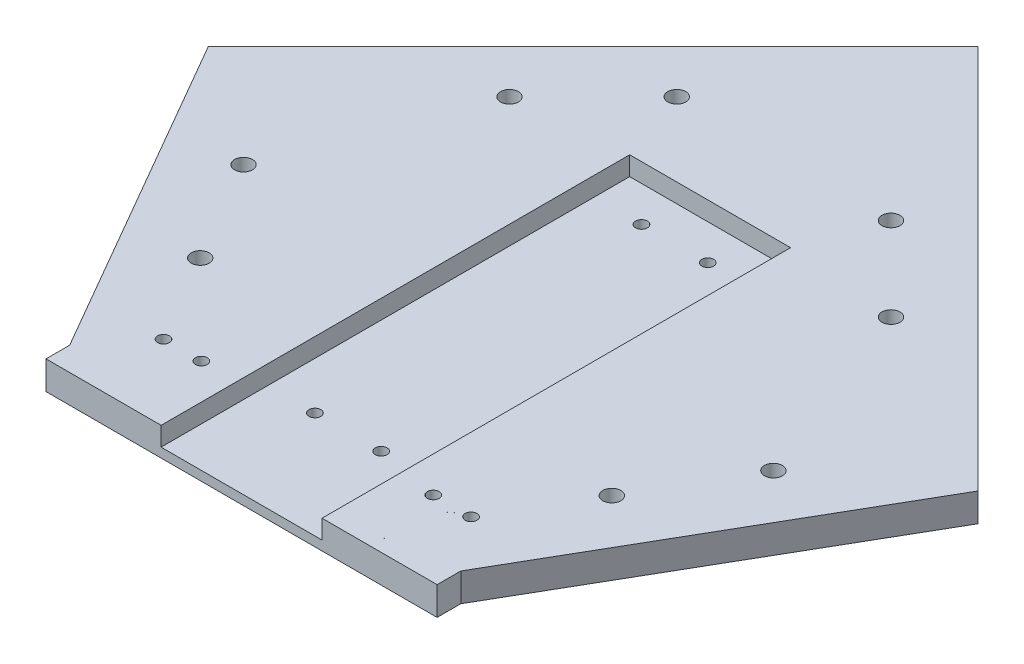
ISO-10303-21;
HEADER;
FILE_DESCRIPTION(('STEP AP214'),'2;1');
FILE_NAME('part.step','',(''),(''),'','','');
FILE_SCHEMA(('AUTOMOTIVE_DESIGN { 1 0 10303 214 1 1 1 1 }'));
ENDSEC;
DATA;
#1=APPLICATION_CONTEXT('core data for automotive mechanical design processes');
#2=APPLICATION_PROTOCOL_DEFINITION('international standard','automotive_design',2000,#1);
#3=PRODUCT_CONTEXT('',#1,'mechanical');
#4=PRODUCT('Part','Part','',(#3));
#5=PRODUCT_RELATED_PRODUCT_CATEGORY('part','',(#4));
#6=PRODUCT_DEFINITION_FORMATION('','',#4);
#7=PRODUCT_DEFINITION_CONTEXT('part definition',#1,'design');
#8=PRODUCT_DEFINITION('design','',#6,#7);
#9=PRODUCT_DEFINITION_SHAPE('','',#8);
#10=(LENGTH_UNIT() NAMED_UNIT(*) SI_UNIT(.MILLI.,.METRE.));
#11=(NAMED_UNIT(*) PLANE_ANGLE_UNIT() SI_UNIT($,.RADIAN.));
#12=(NAMED_UNIT(*) SI_UNIT($,.STERADIAN.) SOLID_ANGLE_UNIT());
#13=UNCERTAINTY_MEASURE_WITH_UNIT(LENGTH_MEASURE(1.E-05),#10,'distance_accuracy_value','');
#14=(GEOMETRIC_REPRESENTATION_CONTEXT(3) GLOBAL_UNCERTAINTY_ASSIGNED_CONTEXT((#13)) GLOBAL_UNIT_ASSIGNED_CONTEXT((#10,
#11,#12)) REPRESENTATION_CONTEXT('',''));
#15=CARTESIAN_POINT('',(0.,0.,0.));
#16=DIRECTION('',(0.,0.,1.));
#17=DIRECTION('',(1.,0.,0.));
#18=AXIS2_PLACEMENT_3D('',#15,#16,#17);
#19=CARTESIAN_POINT('',(0.,6.,0.));
#20=DIRECTION('',(0.,1.,0.));
#21=DIRECTION('',(0.,0.,1.));
#22=AXIS2_PLACEMENT_3D('',#19,#20,#21);
#23=PLANE('',#22);
#24=CARTESIAN_POINT('',(28.5022798364536,6.,73.3791697838743));
#25=DIRECTION('',(0.,1.,0.));
#26=DIRECTION('',(0.,0.,1.));
#27=AXIS2_PLACEMENT_3D('',#24,#25,#26);
#28=CIRCLE('',#27,1.8);
#29=CARTESIAN_POINT('',(28.4999999999973,6.,75.1791683400809));
#30=VERTEX_POINT('',#29);
#31=CARTESIAN_POINT('',(28.4999999999973,6.,71.5791712276678));
#32=VERTEX_POINT('',#31);
#33=EDGE_CURVE('E179',#30,#32,#28,.T.);
#34=ORIENTED_EDGE('',*,*,#33,.F.);
#35=CARTESIAN_POINT('',(28.4977201635464,6.,73.3791697838743));
#36=DIRECTION('',(0.,-1.,0.));
#37=DIRECTION('',(0.,0.,1.));
#38=AXIS2_PLACEMENT_3D('',#35,#36,#37);
#39=CIRCLE('',#38,1.79999999999999);
#40=EDGE_CURVE('E156',#32,#30,#39,.T.);
#41=ORIENTED_EDGE('',*,*,#40,.F.);
#42=EDGE_LOOP('',(#34,#41));
#43=FACE_BOUND('',#42,.T.);
#44=CARTESIAN_POINT('',(32.4977201635464,6.,73.3791697838743));
#45=DIRECTION('',(0.,-1.,0.));
#46=DIRECTION('',(0.,0.,1.));
#47=AXIS2_PLACEMENT_3D('',#44,#45,#46);
#48=CIRCLE('',#47,1.25);
#49=CARTESIAN_POINT('',(32.4977201635464,6.,74.6291697838743));
#50=VERTEX_POINT('',#49);
#51=EDGE_CURVE('E354',#50,#50,#48,.T.);
#52=ORIENTED_EDGE('',*,*,#51,.T.);
#53=EDGE_LOOP('',(#52));
#54=FACE_BOUND('',#53,.T.);
#55=CARTESIAN_POINT('',(-24.4977201635464,6.,73.3791697838743));
#56=DIRECTION('',(0.,1.,0.));
#57=DIRECTION('',(0.,0.,1.));
#58=AXIS2_PLACEMENT_3D('',#55,#56,#57);
#59=CIRCLE('',#58,1.25);
#60=CARTESIAN_POINT('',(-24.4977201635464,6.,74.6291697838743));
#61=VERTEX_POINT('',#60);
#62=EDGE_CURVE('E358',#61,#61,#59,.T.);
#63=ORIENTED_EDGE('',*,*,#62,.F.);
#64=EDGE_LOOP('',(#63));
#65=FACE_BOUND('',#64,.T.);
#66=CARTESIAN_POINT('',(-32.4977201635464,6.,73.3791697838743));
#67=DIRECTION('',(0.,1.,0.));
#68=DIRECTION('',(0.,0.,1.));
#69=AXIS2_PLACEMENT_3D('',#66,#67,#68);
#70=CIRCLE('',#69,1.25);
#71=CARTESIAN_POINT('',(-32.4977201635464,6.,74.6291697838743));
#72=VERTEX_POINT('',#71);
#73=EDGE_CURVE('E362',#72,#72,#70,.T.);
#74=ORIENTED_EDGE('',*,*,#73,.F.);
#75=EDGE_LOOP('',(#74));
#76=FACE_BOUND('',#75,.T.);
#77=CARTESIAN_POINT('',(40.3050865276331,6.,-7.53027951685035));
#78=DIRECTION('',(0.,1.,0.));
#79=DIRECTION('',(0.,0.,1.));
#80=AXIS2_PLACEMENT_3D('',#77,#78,#79);
#81=CIRCLE('',#80,1.9);
#82=CARTESIAN_POINT('',(40.3050865276331,6.,-5.63027951685035));
#83=VERTEX_POINT('',#82);
#84=EDGE_CURVE('E178',#83,#83,#81,.T.);
#85=ORIENTED_EDGE('',*,*,#84,.F.);
#86=EDGE_LOOP('',(#85));
#87=FACE_BOUND('',#86,.T.);
#88=CARTESIAN_POINT('',(22.6274169979695,6.,-25.207949046514));
#89=DIRECTION('',(0.,1.,0.));
#90=DIRECTION('',(0.,0.,1.));
#91=AXIS2_PLACEMENT_3D('',#88,#89,#90);
#92=CIRCLE('',#91,1.9);
#93=CARTESIAN_POINT('',(22.6274169979695,6.,-23.307949046514));
#94=VERTEX_POINT('',#93);
#95=EDGE_CURVE('E203',#94,#94,#92,.T.);
#96=ORIENTED_EDGE('',*,*,#95,.F.);
#97=EDGE_LOOP('',(#96));
#98=FACE_BOUND('',#97,.T.);
#99=CARTESIAN_POINT('',(55.9796296281422,6.,32.9832349863219));
#100=DIRECTION('',(0.,1.,0.));
#101=DIRECTION('',(0.,0.,1.));
#102=AXIS2_PLACEMENT_3D('',#99,#100,#101);
#103=CIRCLE('',#102,1.9);
#104=CARTESIAN_POINT('',(55.9796296281422,6.,34.8832349863219));
#105=VERTEX_POINT('',#104);
#106=EDGE_CURVE('E209',#105,#105,#103,.T.);
#107=ORIENTED_EDGE('',*,*,#106,.F.);
#108=EDGE_LOOP('',(#107));
#109=FACE_BOUND('',#108,.T.);
#110=CARTESIAN_POINT('',(43.4796296281422,6.,54.6338700809329));
#111=DIRECTION('',(0.,1.,0.));
#112=DIRECTION('',(0.,0.,1.));
#113=AXIS2_PLACEMENT_3D('',#110,#111,#112);
#114=CIRCLE('',#113,1.9);
#115=CARTESIAN_POINT('',(43.4796296281422,6.,56.5338700809329));
#116=VERTEX_POINT('',#115);
#117=EDGE_CURVE('E215',#116,#116,#114,.T.);
#118=ORIENTED_EDGE('',*,*,#117,.F.);
#119=EDGE_LOOP('',(#118));
#120=FACE_BOUND('',#119,.T.);
#121=CARTESIAN_POINT('',(-43.479629628142,6.,54.6338700809328));
#122=DIRECTION('',(0.,1.,0.));
#123=DIRECTION('',(0.,0.,1.));
#124=AXIS2_PLACEMENT_3D('',#121,#122,#123);
#125=CIRCLE('',#124,1.9);
#126=CARTESIAN_POINT('',(-43.479629628142,6.,56.5338700809328));
#127=VERTEX_POINT('',#126);
#128=EDGE_CURVE('E221',#127,#127,#125,.T.);
#129=ORIENTED_EDGE('',*,*,#128,.F.);
#130=EDGE_LOOP('',(#129));
#131=FACE_BOUND('',#130,.T.);
#132=CARTESIAN_POINT('',(-55.979629628142,6.,32.9832349863218));
#133=DIRECTION('',(0.,1.,0.));
#134=DIRECTION('',(0.,0.,1.));
#135=AXIS2_PLACEMENT_3D('',#132,#133,#134);
#136=CIRCLE('',#135,1.9);
#137=CARTESIAN_POINT('',(-55.979629628142,6.,34.8832349863218));
#138=VERTEX_POINT('',#137);
#139=EDGE_CURVE('E227',#138,#138,#136,.T.);
#140=ORIENTED_EDGE('',*,*,#139,.F.);
#141=EDGE_LOOP('',(#140));
#142=FACE_BOUND('',#141,.T.);
#143=CARTESIAN_POINT('',(-40.3050865276332,6.,-7.53027951685026));
#144=DIRECTION('',(0.,1.,0.));
#145=DIRECTION('',(0.,0.,1.));
#146=AXIS2_PLACEMENT_3D('',#143,#144,#145);
#147=CIRCLE('',#146,1.9);
#148=CARTESIAN_POINT('',(-40.3050865276332,6.,-5.63027951685026));
#149=VERTEX_POINT('',#148);
#150=EDGE_CURVE('E233',#149,#149,#147,.T.);
#151=ORIENTED_EDGE('',*,*,#150,.F.);
#152=EDGE_LOOP('',(#151));
#153=FACE_BOUND('',#152,.T.);
#154=CARTESIAN_POINT('',(-22.6274169979695,6.,-25.207949046514));
#155=DIRECTION('',(0.,1.,0.));
#156=DIRECTION('',(0.,0.,1.));
#157=AXIS2_PLACEMENT_3D('',#154,#155,#156);
#158=CIRCLE('',#157,1.9);
#159=CARTESIAN_POINT('',(-22.6274169979695,6.,-23.307949046514));
#160=VERTEX_POINT('',#159);
#161=EDGE_CURVE('E239',#160,#160,#158,.T.);
#162=ORIENTED_EDGE('',*,*,#161,.F.);
#163=EDGE_LOOP('',(#162));
#164=FACE_BOUND('',#163,.T.);
#165=DIRECTION('',(0.,0.,1.));
#166=VECTOR('',#165,1.);
#167=CARTESIAN_POINT('',(-16.9977201635464,6.,89.3791697838743));
#168=LINE('',#167,#166);
#169=CARTESIAN_POINT('',(-16.9977201635464,6.,-9.62083021612567));
#170=VERTEX_POINT('',#169);
#171=CARTESIAN_POINT('',(-16.9977201635464,6.,89.3791697838743));
#172=VERTEX_POINT('',#171);
#173=EDGE_CURVE('E245',#170,#172,#168,.T.);
#174=ORIENTED_EDGE('',*,*,#173,.F.);
#175=DIRECTION('',(-1.,0.,0.));
#176=VECTOR('',#175,1.);
#177=CARTESIAN_POINT('',(-16.9977201635464,6.,-9.62083021612567));
#178=LINE('',#177,#176);
#179=CARTESIAN_POINT('',(17.0022798364536,6.,-9.62083021612567));
#180=VERTEX_POINT('',#179);
#181=EDGE_CURVE('E252',#180,#170,#178,.T.);
#182=ORIENTED_EDGE('',*,*,#181,.F.);
#183=DIRECTION('',(0.,0.,-1.));
#184=VECTOR('',#183,1.);
#185=CARTESIAN_POINT('',(17.0022798364536,6.,89.3791697838743));
#186=LINE('',#185,#184);
#187=CARTESIAN_POINT('',(17.0022798364536,6.,89.3791697838743));
#188=VERTEX_POINT('',#187);
#189=EDGE_CURVE('E263',#188,#180,#186,.T.);
#190=ORIENTED_EDGE('',*,*,#189,.F.);
#191=DIRECTION('',(1.,0.,0.));
#192=VECTOR('',#191,1.);
#193=CARTESIAN_POINT('',(0.,6.,89.3791697838743));
#194=LINE('',#193,#192);
#195=CARTESIAN_POINT('',(41.3172798364536,6.,89.379169783874));
#196=VERTEX_POINT('',#195);
#197=EDGE_CURVE('E280',#188,#196,#194,.T.);
#198=ORIENTED_EDGE('',*,*,#197,.T.);
#199=DIRECTION('',(0.,0.,1.));
#200=VECTOR('',#199,1.);
#201=CARTESIAN_POINT('',(41.3172798364532,6.,-1.72017732709916E-13));
#202=LINE('',#201,#200);
#203=CARTESIAN_POINT('',(41.3172798364536,6.,84.379169783874));
#204=VERTEX_POINT('',#203);
#205=EDGE_CURVE('E285',#204,#196,#202,.T.);
#206=ORIENTED_EDGE('',*,*,#205,.F.);
#207=DIRECTION('',(-0.499999999999998,0.,0.86602540378444));
#208=VECTOR('',#207,1.);
#209=CARTESIAN_POINT('',(67.5252121688777,6.,38.985699422788));
#210=LINE('',#209,#208);
#211=CARTESIAN_POINT('',(81.3172798364534,6.,15.0971374811188));
#212=VERTEX_POINT('',#211);
#213=EDGE_CURVE('E288',#212,#204,#210,.T.);
#214=ORIENTED_EDGE('',*,*,#213,.F.);
#215=DIRECTION('',(0.707106781186551,0.,0.707106781186544));
#216=VECTOR('',#215,1.);
#217=CARTESIAN_POINT('',(33.1100711776669,6.,-33.1100711776672));
#218=LINE('',#217,#216);
#219=CARTESIAN_POINT('',(0.,6.,-66.2201423553337));
#220=VERTEX_POINT('',#219);
#221=EDGE_CURVE('E291',#220,#212,#218,.T.);
#222=ORIENTED_EDGE('',*,*,#221,.F.);
#223=DIRECTION('',(-0.707106781186546,0.,0.707106781186549));
#224=VECTOR('',#223,1.);
#225=CARTESIAN_POINT('',(-33.1100711776669,6.,-33.1100711776667));
#226=LINE('',#225,#224);
#227=CARTESIAN_POINT('',(-81.3172798364528,6.,15.0971374811194));
#228=VERTEX_POINT('',#227);
#229=EDGE_CURVE('E294',#220,#228,#226,.T.);
#230=ORIENTED_EDGE('',*,*,#229,.T.);
#231=DIRECTION('',(0.500000000000004,0.,0.866025403784436));
#232=VECTOR('',#231,1.);
#233=CARTESIAN_POINT('',(-67.5252121688771,6.,38.9856994227882));
#234=LINE('',#233,#232);
#235=CARTESIAN_POINT('',(-41.3172798364525,6.,84.3791697838743));
#236=VERTEX_POINT('',#235);
#237=EDGE_CURVE('E296',#228,#236,#234,.T.);
#238=ORIENTED_EDGE('',*,*,#237,.T.);
#239=DIRECTION('',(0.,0.,1.));
#240=VECTOR('',#239,1.);
#241=CARTESIAN_POINT('',(-41.3172798364528,6.,1.72017732709915E-13));
#242=LINE('',#241,#240);
#243=CARTESIAN_POINT('',(-41.3172798364525,6.,89.3791697838743));
#244=VERTEX_POINT('',#243);
#245=EDGE_CURVE('E277',#236,#244,#242,.T.);
#246=ORIENTED_EDGE('',*,*,#245,.T.);
#247=EDGE_CURVE('E282',#244,#172,#194,.T.);
#248=ORIENTED_EDGE('',*,*,#247,.T.);
#249=EDGE_LOOP('',(#174,#182,#190,#198,#206,#214,#222,#230,#238,#246,#248));
#250=FACE_BOUND('',#249,.T.);
#251=CARTESIAN_POINT('',(24.4977201635464,6.,73.3791697838743));
#252=DIRECTION('',(0.,-1.,0.));
#253=DIRECTION('',(0.,0.,1.));
#254=AXIS2_PLACEMENT_3D('',#251,#252,#253);
#255=CIRCLE('',#254,1.25);
#256=CARTESIAN_POINT('',(24.4977201635464,6.,74.6291697838743));
#257=VERTEX_POINT('',#256);
#258=EDGE_CURVE('E346',#257,#257,#255,.T.);
#259=ORIENTED_EDGE('',*,*,#258,.T.);
#260=EDGE_LOOP('',(#259));
#261=FACE_BOUND('',#260,.T.);
#262=CARTESIAN_POINT('',(26.0022798364536,6.,86.3791697838743));
#263=DIRECTION('',(0.,1.,0.));
#264=DIRECTION('',(0.,0.,1.));
#265=AXIS2_PLACEMENT_3D('',#262,#263,#264);
#266=CIRCLE('',#265,1.25);
#267=CARTESIAN_POINT('',(26.0000000000009,6.,87.6291677048109));
#268=VERTEX_POINT('',#267);
#269=CARTESIAN_POINT('',(26.0000000000009,6.,85.1291718629378));
#270=VERTEX_POINT('',#269);
#271=EDGE_CURVE('E43',#268,#270,#266,.T.);
#272=ORIENTED_EDGE('',*,*,#271,.F.);
#273=CARTESIAN_POINT('',(25.9977201635464,6.,86.3791697838743));
#274=DIRECTION('',(0.,-1.,0.));
#275=DIRECTION('',(0.,0.,1.));
#276=AXIS2_PLACEMENT_3D('',#273,#274,#275);
#277=CIRCLE('',#276,1.25);
#278=EDGE_CURVE('E151',#270,#268,#277,.T.);
#279=ORIENTED_EDGE('',*,*,#278,.F.);
#280=EDGE_LOOP('',(#272,#279));
#281=FACE_BOUND('',#280,.T.);
#282=ADVANCED_FACE('F39',(#43,#54,#65,#76,#87,#98,#109,#120,#131,#142,#153,#164,#250,#261,#281),
#23,.T.);
#283=CARTESIAN_POINT('',(0.,0.,0.));
#284=DIRECTION('',(0.,1.,0.));
#285=DIRECTION('',(0.,0.,1.));
#286=AXIS2_PLACEMENT_3D('',#283,#284,#285);
#287=PLANE('',#286);
#288=CARTESIAN_POINT('',(28.5022798364536,0.,73.3791697838743));
#289=DIRECTION('',(0.,1.,0.));
#290=DIRECTION('',(0.,0.,1.));
#291=AXIS2_PLACEMENT_3D('',#288,#289,#290);
#292=CIRCLE('',#291,1.8);
#293=CARTESIAN_POINT('',(28.4999999999973,0.,75.1791683400809));
#294=VERTEX_POINT('',#293);
#295=CARTESIAN_POINT('',(28.4999999999973,0.,71.5791712276678));
#296=VERTEX_POINT('',#295);
#297=EDGE_CURVE('E174',#294,#296,#292,.T.);
#298=ORIENTED_EDGE('',*,*,#297,.T.);
#299=CARTESIAN_POINT('',(28.4977201635464,0.,73.3791697838743));
#300=DIRECTION('',(0.,-1.,0.));
#301=DIRECTION('',(0.,0.,1.));
#302=AXIS2_PLACEMENT_3D('',#299,#300,#301);
#303=CIRCLE('',#302,1.79999999999999);
#304=EDGE_CURVE('E340',#296,#294,#303,.T.);
#305=ORIENTED_EDGE('',*,*,#304,.T.);
#306=EDGE_LOOP('',(#298,#305));
#307=FACE_BOUND('',#306,.T.);
#308=CARTESIAN_POINT('',(32.4977201635464,0.,73.3791697838743));
#309=DIRECTION('',(0.,1.,0.));
#310=DIRECTION('',(0.,0.,1.));
#311=AXIS2_PLACEMENT_3D('',#308,#309,#310);
#312=CIRCLE('',#311,1.25);
#313=CARTESIAN_POINT('',(32.4977201635464,0.,74.6291697838743));
#314=VERTEX_POINT('',#313);
#315=EDGE_CURVE('E357',#314,#314,#312,.F.);
#316=ORIENTED_EDGE('',*,*,#315,.F.);
#317=EDGE_LOOP('',(#316));
#318=FACE_BOUND('',#317,.T.);
#319=CARTESIAN_POINT('',(-24.4977201635464,0.,73.3791697838743));
#320=DIRECTION('',(0.,1.,0.));
#321=DIRECTION('',(0.,0.,1.));
#322=AXIS2_PLACEMENT_3D('',#319,#320,#321);
#323=CIRCLE('',#322,1.25);
#324=CARTESIAN_POINT('',(-24.4977201635464,0.,74.6291697838743));
#325=VERTEX_POINT('',#324);
#326=EDGE_CURVE('E361',#325,#325,#323,.T.);
#327=ORIENTED_EDGE('',*,*,#326,.T.);
#328=EDGE_LOOP('',(#327));
#329=FACE_BOUND('',#328,.T.);
#330=CARTESIAN_POINT('',(-32.4977201635464,0.,73.3791697838743));
#331=DIRECTION('',(0.,1.,0.));
#332=DIRECTION('',(0.,0.,1.));
#333=AXIS2_PLACEMENT_3D('',#330,#331,#332);
#334=CIRCLE('',#333,1.25);
#335=CARTESIAN_POINT('',(-32.4977201635464,0.,74.6291697838743));
#336=VERTEX_POINT('',#335);
#337=EDGE_CURVE('E188',#336,#336,#334,.T.);
#338=ORIENTED_EDGE('',*,*,#337,.T.);
#339=EDGE_LOOP('',(#338));
#340=FACE_BOUND('',#339,.T.);
#341=CARTESIAN_POINT('',(7.00227983645358,0.,66.8791697838743));
#342=DIRECTION('',(0.,1.,0.));
#343=DIRECTION('',(0.,0.,1.));
#344=AXIS2_PLACEMENT_3D('',#341,#342,#343);
#345=CIRCLE('',#344,1.25);
#346=CARTESIAN_POINT('',(7.00227983645358,0.,68.1291697838743));
#347=VERTEX_POINT('',#346);
#348=EDGE_CURVE('E368',#347,#347,#345,.T.);
#349=ORIENTED_EDGE('',*,*,#348,.T.);
#350=EDGE_LOOP('',(#349));
#351=FACE_BOUND('',#350,.T.);
#352=CARTESIAN_POINT('',(-6.99772016354642,0.,66.8791697838743));
#353=DIRECTION('',(0.,1.,0.));
#354=DIRECTION('',(0.,0.,1.));
#355=AXIS2_PLACEMENT_3D('',#352,#353,#354);
#356=CIRCLE('',#355,1.25);
#357=CARTESIAN_POINT('',(-6.99772016354642,0.,68.1291697838743));
#358=VERTEX_POINT('',#357);
#359=EDGE_CURVE('E374',#358,#358,#356,.T.);
#360=ORIENTED_EDGE('',*,*,#359,.T.);
#361=EDGE_LOOP('',(#360));
#362=FACE_BOUND('',#361,.T.);
#363=CARTESIAN_POINT('',(-6.99772016354642,0.,-2.12083021612567));
#364=DIRECTION('',(0.,1.,0.));
#365=DIRECTION('',(0.,0.,1.));
#366=AXIS2_PLACEMENT_3D('',#363,#364,#365);
#367=CIRCLE('',#366,1.25);
#368=CARTESIAN_POINT('',(-6.99772016354642,0.,-0.870830216125673));
#369=VERTEX_POINT('',#368);
#370=EDGE_CURVE('E380',#369,#369,#367,.T.);
#371=ORIENTED_EDGE('',*,*,#370,.T.);
#372=EDGE_LOOP('',(#371));
#373=FACE_BOUND('',#372,.T.);
#374=CARTESIAN_POINT('',(7.00227983645358,0.,-2.12083021612567));
#375=DIRECTION('',(0.,1.,0.));
#376=DIRECTION('',(0.,0.,1.));
#377=AXIS2_PLACEMENT_3D('',#374,#375,#376);
#378=CIRCLE('',#377,1.25);
#379=CARTESIAN_POINT('',(7.00227983645358,0.,-0.870830216125675));
#380=VERTEX_POINT('',#379);
#381=EDGE_CURVE('E147',#380,#380,#378,.T.);
#382=ORIENTED_EDGE('',*,*,#381,.T.);
#383=EDGE_LOOP('',(#382));
#384=FACE_BOUND('',#383,.T.);
#385=CARTESIAN_POINT('',(40.3050865276331,0.,-7.53027951685035));
#386=DIRECTION('',(0.,1.,0.));
#387=DIRECTION('',(0.,0.,1.));
#388=AXIS2_PLACEMENT_3D('',#385,#386,#387);
#389=CIRCLE('',#388,1.9);
#390=CARTESIAN_POINT('',(40.3050865276331,0.,-5.63027951685035));
#391=VERTEX_POINT('',#390);
#392=EDGE_CURVE('E200',#391,#391,#389,.T.);
#393=ORIENTED_EDGE('',*,*,#392,.T.);
#394=EDGE_LOOP('',(#393));
#395=FACE_BOUND('',#394,.T.);
#396=CARTESIAN_POINT('',(22.6274169979695,0.,-25.207949046514));
#397=DIRECTION('',(0.,1.,0.));
#398=DIRECTION('',(0.,0.,1.));
#399=AXIS2_PLACEMENT_3D('',#396,#397,#398);
#400=CIRCLE('',#399,1.9);
#401=CARTESIAN_POINT('',(22.6274169979695,0.,-23.307949046514));
#402=VERTEX_POINT('',#401);
#403=EDGE_CURVE('E206',#402,#402,#400,.T.);
#404=ORIENTED_EDGE('',*,*,#403,.T.);
#405=EDGE_LOOP('',(#404));
#406=FACE_BOUND('',#405,.T.);
#407=CARTESIAN_POINT('',(55.9796296281422,0.,32.9832349863219));
#408=DIRECTION('',(0.,1.,0.));
#409=DIRECTION('',(0.,0.,1.));
#410=AXIS2_PLACEMENT_3D('',#407,#408,#409);
#411=CIRCLE('',#410,1.9);
#412=CARTESIAN_POINT('',(55.9796296281422,0.,34.8832349863219));
#413=VERTEX_POINT('',#412);
#414=EDGE_CURVE('E212',#413,#413,#411,.T.);
#415=ORIENTED_EDGE('',*,*,#414,.T.);
#416=EDGE_LOOP('',(#415));
#417=FACE_BOUND('',#416,.T.);
#418=CARTESIAN_POINT('',(43.4796296281422,0.,54.6338700809329));
#419=DIRECTION('',(0.,1.,0.));
#420=DIRECTION('',(0.,0.,1.));
#421=AXIS2_PLACEMENT_3D('',#418,#419,#420);
#422=CIRCLE('',#421,1.9);
#423=CARTESIAN_POINT('',(43.4796296281422,0.,56.5338700809329));
#424=VERTEX_POINT('',#423);
#425=EDGE_CURVE('E218',#424,#424,#422,.T.);
#426=ORIENTED_EDGE('',*,*,#425,.T.);
#427=EDGE_LOOP('',(#426));
#428=FACE_BOUND('',#427,.T.);
#429=CARTESIAN_POINT('',(-43.479629628142,0.,54.6338700809328));
#430=DIRECTION('',(0.,1.,0.));
#431=DIRECTION('',(0.,0.,1.));
#432=AXIS2_PLACEMENT_3D('',#429,#430,#431);
#433=CIRCLE('',#432,1.9);
#434=CARTESIAN_POINT('',(-43.479629628142,0.,56.5338700809328));
#435=VERTEX_POINT('',#434);
#436=EDGE_CURVE('E224',#435,#435,#433,.T.);
#437=ORIENTED_EDGE('',*,*,#436,.T.);
#438=EDGE_LOOP('',(#437));
#439=FACE_BOUND('',#438,.T.);
#440=CARTESIAN_POINT('',(-55.979629628142,0.,32.9832349863218));
#441=DIRECTION('',(0.,1.,0.));
#442=DIRECTION('',(0.,0.,1.));
#443=AXIS2_PLACEMENT_3D('',#440,#441,#442);
#444=CIRCLE('',#443,1.9);
#445=CARTESIAN_POINT('',(-55.979629628142,0.,34.8832349863218));
#446=VERTEX_POINT('',#445);
#447=EDGE_CURVE('E230',#446,#446,#444,.T.);
#448=ORIENTED_EDGE('',*,*,#447,.T.);
#449=EDGE_LOOP('',(#448));
#450=FACE_BOUND('',#449,.T.);
#451=CARTESIAN_POINT('',(-40.3050865276332,0.,-7.53027951685026));
#452=DIRECTION('',(0.,1.,0.));
#453=DIRECTION('',(0.,0.,1.));
#454=AXIS2_PLACEMENT_3D('',#451,#452,#453);
#455=CIRCLE('',#454,1.9);
#456=CARTESIAN_POINT('',(-40.3050865276332,0.,-5.63027951685026));
#457=VERTEX_POINT('',#456);
#458=EDGE_CURVE('E236',#457,#457,#455,.T.);
#459=ORIENTED_EDGE('',*,*,#458,.T.);
#460=EDGE_LOOP('',(#459));
#461=FACE_BOUND('',#460,.T.);
#462=CARTESIAN_POINT('',(-22.6274169979695,0.,-25.207949046514));
#463=DIRECTION('',(0.,1.,0.));
#464=DIRECTION('',(0.,0.,1.));
#465=AXIS2_PLACEMENT_3D('',#462,#463,#464);
#466=CIRCLE('',#465,1.9);
#467=CARTESIAN_POINT('',(-22.6274169979695,0.,-23.307949046514));
#468=VERTEX_POINT('',#467);
#469=EDGE_CURVE('E242',#468,#468,#466,.T.);
#470=ORIENTED_EDGE('',*,*,#469,.T.);
#471=EDGE_LOOP('',(#470));
#472=FACE_BOUND('',#471,.T.);
#473=DIRECTION('',(0.,0.,1.));
#474=VECTOR('',#473,1.);
#475=CARTESIAN_POINT('',(-41.3172798364528,0.,1.72017732709915E-13));
#476=LINE('',#475,#474);
#477=CARTESIAN_POINT('',(-41.3172798364525,0.,84.3791697838743));
#478=VERTEX_POINT('',#477);
#479=CARTESIAN_POINT('',(-41.3172798364525,0.,89.3791697838743));
#480=VERTEX_POINT('',#479);
#481=EDGE_CURVE('E270',#478,#480,#476,.T.);
#482=ORIENTED_EDGE('',*,*,#481,.F.);
#483=DIRECTION('',(0.500000000000004,0.,0.866025403784436));
#484=VECTOR('',#483,1.);
#485=CARTESIAN_POINT('',(-67.5252121688771,0.,38.9856994227882));
#486=LINE('',#485,#484);
#487=CARTESIAN_POINT('',(-81.3172798364528,0.,15.0971374811194));
#488=VERTEX_POINT('',#487);
#489=EDGE_CURVE('E281',#488,#478,#486,.T.);
#490=ORIENTED_EDGE('',*,*,#489,.F.);
#491=DIRECTION('',(-0.707106781186546,0.,0.707106781186549));
#492=VECTOR('',#491,1.);
#493=CARTESIAN_POINT('',(-33.1100711776669,0.,-33.1100711776667));
#494=LINE('',#493,#492);
#495=CARTESIAN_POINT('',(0.,0.,-66.2201423553337));
#496=VERTEX_POINT('',#495);
#497=EDGE_CURVE('E313',#496,#488,#494,.T.);
#498=ORIENTED_EDGE('',*,*,#497,.F.);
#499=DIRECTION('',(0.707106781186551,0.,0.707106781186544));
#500=VECTOR('',#499,1.);
#501=CARTESIAN_POINT('',(33.1100711776669,0.,-33.1100711776672));
#502=LINE('',#501,#500);
#503=CARTESIAN_POINT('',(81.3172798364534,0.,15.0971374811188));
#504=VERTEX_POINT('',#503);
#505=EDGE_CURVE('E310',#496,#504,#502,.T.);
#506=ORIENTED_EDGE('',*,*,#505,.T.);
#507=DIRECTION('',(-0.499999999999998,0.,0.86602540378444));
#508=VECTOR('',#507,1.);
#509=CARTESIAN_POINT('',(67.5252121688777,0.,38.985699422788));
#510=LINE('',#509,#508);
#511=CARTESIAN_POINT('',(41.3172798364536,0.,84.379169783874));
#512=VERTEX_POINT('',#511);
#513=EDGE_CURVE('E307',#504,#512,#510,.T.);
#514=ORIENTED_EDGE('',*,*,#513,.T.);
#515=DIRECTION('',(0.,0.,1.));
#516=VECTOR('',#515,1.);
#517=CARTESIAN_POINT('',(41.3172798364532,0.,-1.72017732709916E-13));
#518=LINE('',#517,#516);
#519=CARTESIAN_POINT('',(41.3172798364536,0.,89.379169783874));
#520=VERTEX_POINT('',#519);
#521=EDGE_CURVE('E304',#512,#520,#518,.T.);
#522=ORIENTED_EDGE('',*,*,#521,.T.);
#523=DIRECTION('',(1.,0.,0.));
#524=VECTOR('',#523,1.);
#525=CARTESIAN_POINT('',(0.,0.,89.3791697838743));
#526=LINE('',#525,#524);
#527=EDGE_CURVE('E301',#480,#520,#526,.T.);
#528=ORIENTED_EDGE('',*,*,#527,.F.);
#529=EDGE_LOOP('',(#482,#490,#498,#506,#514,#522,#528));
#530=FACE_BOUND('',#529,.T.);
#531=CARTESIAN_POINT('',(24.4977201635464,0.,73.3791697838743));
#532=DIRECTION('',(0.,1.,0.));
#533=DIRECTION('',(0.,0.,1.));
#534=AXIS2_PLACEMENT_3D('',#531,#532,#533);
#535=CIRCLE('',#534,1.25);
#536=CARTESIAN_POINT('',(24.4977201635464,0.,74.6291697838743));
#537=VERTEX_POINT('',#536);
#538=EDGE_CURVE('E172',#537,#537,#535,.F.);
#539=ORIENTED_EDGE('',*,*,#538,.F.);
#540=EDGE_LOOP('',(#539));
#541=FACE_BOUND('',#540,.T.);
#542=CARTESIAN_POINT('',(26.0022798364536,0.,86.3791697838743));
#543=DIRECTION('',(0.,1.,0.));
#544=DIRECTION('',(0.,0.,1.));
#545=AXIS2_PLACEMENT_3D('',#542,#543,#544);
#546=CIRCLE('',#545,1.25);
#547=CARTESIAN_POINT('',(26.0000000000009,0.,87.6291677048109));
#548=VERTEX_POINT('',#547);
#549=CARTESIAN_POINT('',(26.0000000000009,0.,85.1291718629378));
#550=VERTEX_POINT('',#549);
#551=EDGE_CURVE('E57',#548,#550,#546,.T.);
#552=ORIENTED_EDGE('',*,*,#551,.T.);
#553=CARTESIAN_POINT('',(25.9977201635464,0.,86.3791697838743));
#554=DIRECTION('',(0.,-1.,0.));
#555=DIRECTION('',(0.,0.,1.));
#556=AXIS2_PLACEMENT_3D('',#553,#554,#555);
#557=CIRCLE('',#556,1.25);
#558=EDGE_CURVE('E153',#550,#548,#557,.T.);
#559=ORIENTED_EDGE('',*,*,#558,.T.);
#560=EDGE_LOOP('',(#552,#559));
#561=FACE_BOUND('',#560,.T.);
#562=ADVANCED_FACE('F388',(#307,#318,#329,#340,#351,#362,#373,#384,#395,#406,#417,#428,#439,
#450,#461,#472,#530,#541,#561),#287,.F.);
#563=CARTESIAN_POINT('',(26.0022798364536,-4.,86.3791697838743));
#564=DIRECTION('',(0.,1.,0.));
#565=DIRECTION('',(0.,0.,1.));
#566=AXIS2_PLACEMENT_3D('',#563,#564,#565);
#567=CYLINDRICAL_SURFACE('',#566,1.25);
#568=DIRECTION('',(0.,1.,0.));
#569=VECTOR('',#568,1.);
#570=CARTESIAN_POINT('',(26.0000000000009,3.,87.6291677048109));
#571=LINE('',#570,#569);
#572=EDGE_CURVE('E11',#268,#548,#571,.F.);
#573=ORIENTED_EDGE('',*,*,#572,.F.);
#574=ORIENTED_EDGE('',*,*,#271,.T.);
#575=DIRECTION('',(0.,1.,0.));
#576=VECTOR('',#575,1.);
#577=CARTESIAN_POINT('',(26.0000000000009,3.,85.1291718629378));
#578=LINE('',#577,#576);
#579=EDGE_CURVE('E49',#550,#270,#578,.T.);
#580=ORIENTED_EDGE('',*,*,#579,.F.);
#581=ORIENTED_EDGE('',*,*,#551,.F.);
#582=EDGE_LOOP('',(#573,#574,#580,#581));
#583=FACE_BOUND('',#582,.T.);
#584=ADVANCED_FACE('F143',(#583),#567,.F.);
#585=CARTESIAN_POINT('',(28.5022798364536,-4.,73.3791697838743));
#586=DIRECTION('',(0.,1.,0.));
#587=DIRECTION('',(0.,0.,1.));
#588=AXIS2_PLACEMENT_3D('',#585,#586,#587);
#589=CYLINDRICAL_SURFACE('',#588,1.8);
#590=DIRECTION('',(0.,1.,0.));
#591=VECTOR('',#590,1.);
#592=CARTESIAN_POINT('',(28.4999999999973,3.,75.1791683400809));
#593=LINE('',#592,#591);
#594=EDGE_CURVE('E154',#30,#294,#593,.F.);
#595=ORIENTED_EDGE('',*,*,#594,.F.);
#596=ORIENTED_EDGE('',*,*,#33,.T.);
#597=DIRECTION('',(0.,1.,0.));
#598=VECTOR('',#597,1.);
#599=CARTESIAN_POINT('',(28.4999999999973,3.,71.5791712276678));
#600=LINE('',#599,#598);
#601=EDGE_CURVE('E171',#296,#32,#600,.T.);
#602=ORIENTED_EDGE('',*,*,#601,.F.);
#603=ORIENTED_EDGE('',*,*,#297,.F.);
#604=EDGE_LOOP('',(#595,#596,#602,#603));
#605=FACE_BOUND('',#604,.T.);
#606=ADVANCED_FACE('F442',(#605),#589,.F.);
#607=CARTESIAN_POINT('',(-41.3172798364528,6.,1.72017732709915E-13));
#608=DIRECTION('',(1.,0.,0.));
#609=DIRECTION('',(0.,0.,-1.));
#610=AXIS2_PLACEMENT_3D('',#607,#608,#609);
#611=PLANE('',#610);
#612=ORIENTED_EDGE('',*,*,#481,.T.);
#613=DIRECTION('',(0.,-1.,0.));
#614=VECTOR('',#613,1.);
#615=CARTESIAN_POINT('',(-41.3172798364525,6.,89.3791697838743));
#616=LINE('',#615,#614);
#617=EDGE_CURVE('E184',#244,#480,#616,.T.);
#618=ORIENTED_EDGE('',*,*,#617,.F.);
#619=ORIENTED_EDGE('',*,*,#245,.F.);
#620=DIRECTION('',(0.,-1.,0.));
#621=VECTOR('',#620,1.);
#622=CARTESIAN_POINT('',(-41.3172798364525,6.,84.3791697838743));
#623=LINE('',#622,#621);
#624=EDGE_CURVE('E298',#236,#478,#623,.T.);
#625=ORIENTED_EDGE('',*,*,#624,.T.);
#626=EDGE_LOOP('',(#612,#618,#619,#625));
#627=FACE_BOUND('',#626,.T.);
#628=ADVANCED_FACE('F41',(#627),#611,.F.);
#629=CARTESIAN_POINT('',(0.,6.,89.3791697838743));
#630=DIRECTION('',(0.,0.,-1.));
#631=DIRECTION('',(-1.,0.,0.));
#632=AXIS2_PLACEMENT_3D('',#629,#630,#631);
#633=PLANE('',#632);
#634=DIRECTION('',(1.,0.,0.));
#635=VECTOR('',#634,1.);
#636=CARTESIAN_POINT('',(-16.9977201635464,2.,89.3791697838743));
#637=LINE('',#636,#635);
#638=CARTESIAN_POINT('',(-16.9977201635464,2.,89.3791697838743));
#639=VERTEX_POINT('',#638);
#640=CARTESIAN_POINT('',(17.0022798364536,2.,89.3791697838743));
#641=VERTEX_POINT('',#640);
#642=EDGE_CURVE('E251',#639,#641,#637,.T.);
#643=ORIENTED_EDGE('',*,*,#642,.F.);
#644=DIRECTION('',(0.,1.,0.));
#645=VECTOR('',#644,1.);
#646=CARTESIAN_POINT('',(-16.9977201635464,2.,89.3791697838743));
#647=LINE('',#646,#645);
#648=EDGE_CURVE('E261',#639,#172,#647,.T.);
#649=ORIENTED_EDGE('',*,*,#648,.T.);
#650=ORIENTED_EDGE('',*,*,#247,.F.);
#651=ORIENTED_EDGE('',*,*,#617,.T.);
#652=ORIENTED_EDGE('',*,*,#527,.T.);
#653=DIRECTION('',(0.,-1.,0.));
#654=VECTOR('',#653,1.);
#655=CARTESIAN_POINT('',(41.3172798364536,6.,89.379169783874));
#656=LINE('',#655,#654);
#657=EDGE_CURVE('E326',#196,#520,#656,.T.);
#658=ORIENTED_EDGE('',*,*,#657,.F.);
#659=ORIENTED_EDGE('',*,*,#197,.F.);
#660=DIRECTION('',(0.,1.,0.));
#661=VECTOR('',#660,1.);
#662=CARTESIAN_POINT('',(17.0022798364536,2.,89.3791697838743));
#663=LINE('',#662,#661);
#664=EDGE_CURVE('E273',#641,#188,#663,.T.);
#665=ORIENTED_EDGE('',*,*,#664,.F.);
#666=EDGE_LOOP('',(#643,#649,#650,#651,#652,#658,#659,#665));
#667=FACE_BOUND('',#666,.T.);
#668=ADVANCED_FACE('F437',(#667),#633,.F.);
#669=CARTESIAN_POINT('',(41.3172798364532,6.,-1.72017732709916E-13));
#670=DIRECTION('',(1.,0.,0.));
#671=DIRECTION('',(0.,0.,-1.));
#672=AXIS2_PLACEMENT_3D('',#669,#670,#671);
#673=PLANE('',#672);
#674=ORIENTED_EDGE('',*,*,#521,.F.);
#675=DIRECTION('',(0.,-1.,0.));
#676=VECTOR('',#675,1.);
#677=CARTESIAN_POINT('',(41.3172798364536,6.,84.379169783874));
#678=LINE('',#677,#676);
#679=EDGE_CURVE('E325',#204,#512,#678,.T.);
#680=ORIENTED_EDGE('',*,*,#679,.F.);
#681=ORIENTED_EDGE('',*,*,#205,.T.);
#682=ORIENTED_EDGE('',*,*,#657,.T.);
#683=EDGE_LOOP('',(#674,#680,#681,#682));
#684=FACE_BOUND('',#683,.T.);
#685=ADVANCED_FACE('F434',(#684),#673,.T.);
#686=CARTESIAN_POINT('',(67.5252121688777,6.,38.985699422788));
#687=DIRECTION('',(0.86602540378444,0.,0.499999999999998));
#688=DIRECTION('',(0.499999999999998,0.,-0.86602540378444));
#689=AXIS2_PLACEMENT_3D('',#686,#687,#688);
#690=PLANE('',#689);
#691=ORIENTED_EDGE('',*,*,#513,.F.);
#692=DIRECTION('',(0.,-1.,0.));
#693=VECTOR('',#692,1.);
#694=CARTESIAN_POINT('',(81.3172798364534,6.,15.0971374811188));
#695=LINE('',#694,#693);
#696=EDGE_CURVE('E323',#212,#504,#695,.T.);
#697=ORIENTED_EDGE('',*,*,#696,.F.);
#698=ORIENTED_EDGE('',*,*,#213,.T.);
#699=ORIENTED_EDGE('',*,*,#679,.T.);
#700=EDGE_LOOP('',(#691,#697,#698,#699));
#701=FACE_BOUND('',#700,.T.);
#702=ADVANCED_FACE('F430',(#701),#690,.T.);
#703=CARTESIAN_POINT('',(33.1100711776669,6.,-33.1100711776672));
#704=DIRECTION('',(0.707106781186544,0.,-0.707106781186551));
#705=DIRECTION('',(-0.707106781186551,0.,-0.707106781186544));
#706=AXIS2_PLACEMENT_3D('',#703,#704,#705);
#707=PLANE('',#706);
#708=ORIENTED_EDGE('',*,*,#505,.F.);
#709=DIRECTION('',(0.,-1.,0.));
#710=VECTOR('',#709,1.);
#711=CARTESIAN_POINT('',(0.,6.,-66.2201423553337));
#712=LINE('',#711,#710);
#713=EDGE_CURVE('E321',#220,#496,#712,.T.);
#714=ORIENTED_EDGE('',*,*,#713,.F.);
#715=ORIENTED_EDGE('',*,*,#221,.T.);
#716=ORIENTED_EDGE('',*,*,#696,.T.);
#717=EDGE_LOOP('',(#708,#714,#715,#716));
#718=FACE_BOUND('',#717,.T.);
#719=ADVANCED_FACE('F426',(#718),#707,.T.);
#720=CARTESIAN_POINT('',(-33.1100711776669,6.,-33.1100711776667));
#721=DIRECTION('',(0.707106781186549,0.,0.707106781186546));
#722=DIRECTION('',(0.707106781186546,0.,-0.707106781186549));
#723=AXIS2_PLACEMENT_3D('',#720,#721,#722);
#724=PLANE('',#723);
#725=ORIENTED_EDGE('',*,*,#497,.T.);
#726=DIRECTION('',(0.,-1.,0.));
#727=VECTOR('',#726,1.);
#728=CARTESIAN_POINT('',(-81.3172798364528,6.,15.0971374811194));
#729=LINE('',#728,#727);
#730=EDGE_CURVE('E318',#228,#488,#729,.T.);
#731=ORIENTED_EDGE('',*,*,#730,.F.);
#732=ORIENTED_EDGE('',*,*,#229,.F.);
#733=ORIENTED_EDGE('',*,*,#713,.T.);
#734=EDGE_LOOP('',(#725,#731,#732,#733));
#735=FACE_BOUND('',#734,.T.);
#736=ADVANCED_FACE('F422',(#735),#724,.F.);
#737=CARTESIAN_POINT('',(-67.5252121688771,6.,38.9856994227882));
#738=DIRECTION('',(0.866025403784436,0.,-0.500000000000004));
#739=DIRECTION('',(-0.500000000000004,0.,-0.866025403784436));
#740=AXIS2_PLACEMENT_3D('',#737,#738,#739);
#741=PLANE('',#740);
#742=ORIENTED_EDGE('',*,*,#489,.T.);
#743=ORIENTED_EDGE('',*,*,#624,.F.);
#744=ORIENTED_EDGE('',*,*,#237,.F.);
#745=ORIENTED_EDGE('',*,*,#730,.T.);
#746=EDGE_LOOP('',(#742,#743,#744,#745));
#747=FACE_BOUND('',#746,.T.);
#748=ADVANCED_FACE('F419',(#747),#741,.F.);
#749=CARTESIAN_POINT('',(-16.9977201635464,2.,89.3791697838743));
#750=DIRECTION('',(-1.,0.,0.));
#751=DIRECTION('',(0.,0.,1.));
#752=AXIS2_PLACEMENT_3D('',#749,#750,#751);
#753=PLANE('',#752);
#754=ORIENTED_EDGE('',*,*,#173,.T.);
#755=ORIENTED_EDGE('',*,*,#648,.F.);
#756=DIRECTION('',(0.,0.,1.));
#757=VECTOR('',#756,1.);
#758=CARTESIAN_POINT('',(-16.9977201635464,2.,89.3791697838743));
#759=LINE('',#758,#757);
#760=CARTESIAN_POINT('',(-16.9977201635464,2.,-9.62083021612567));
#761=VERTEX_POINT('',#760);
#762=EDGE_CURVE('E248',#761,#639,#759,.T.);
#763=ORIENTED_EDGE('',*,*,#762,.F.);
#764=DIRECTION('',(0.,1.,0.));
#765=VECTOR('',#764,1.);
#766=CARTESIAN_POINT('',(-16.9977201635464,2.,-9.62083021612567));
#767=LINE('',#766,#765);
#768=EDGE_CURVE('E268',#761,#170,#767,.T.);
#769=ORIENTED_EDGE('',*,*,#768,.T.);
#770=EDGE_LOOP('',(#754,#755,#763,#769));
#771=FACE_BOUND('',#770,.T.);
#772=ADVANCED_FACE('F416',(#771),#753,.F.);
#773=CARTESIAN_POINT('',(-16.9977201635464,2.,-9.62083021612567));
#774=DIRECTION('',(0.,0.,-1.));
#775=DIRECTION('',(-1.,0.,0.));
#776=AXIS2_PLACEMENT_3D('',#773,#774,#775);
#777=PLANE('',#776);
#778=ORIENTED_EDGE('',*,*,#181,.T.);
#779=ORIENTED_EDGE('',*,*,#768,.F.);
#780=DIRECTION('',(-1.,0.,0.));
#781=VECTOR('',#780,1.);
#782=CARTESIAN_POINT('',(-16.9977201635464,2.,-9.62083021612567));
#783=LINE('',#782,#781);
#784=CARTESIAN_POINT('',(17.0022798364536,2.,-9.62083021612567));
#785=VERTEX_POINT('',#784);
#786=EDGE_CURVE('E258',#785,#761,#783,.T.);
#787=ORIENTED_EDGE('',*,*,#786,.F.);
#788=DIRECTION('',(0.,1.,0.));
#789=VECTOR('',#788,1.);
#790=CARTESIAN_POINT('',(17.0022798364536,2.,-9.62083021612567));
#791=LINE('',#790,#789);
#792=EDGE_CURVE('E271',#785,#180,#791,.T.);
#793=ORIENTED_EDGE('',*,*,#792,.T.);
#794=EDGE_LOOP('',(#778,#779,#787,#793));
#795=FACE_BOUND('',#794,.T.);
#796=ADVANCED_FACE('F475',(#795),#777,.F.);
#797=CARTESIAN_POINT('',(17.0022798364536,2.,89.3791697838743));
#798=DIRECTION('',(1.,0.,0.));
#799=DIRECTION('',(0.,0.,-1.));
#800=AXIS2_PLACEMENT_3D('',#797,#798,#799);
#801=PLANE('',#800);
#802=ORIENTED_EDGE('',*,*,#189,.T.);
#803=ORIENTED_EDGE('',*,*,#792,.F.);
#804=DIRECTION('',(0.,0.,-1.));
#805=VECTOR('',#804,1.);
#806=CARTESIAN_POINT('',(17.0022798364536,2.,89.3791697838743));
#807=LINE('',#806,#805);
#808=EDGE_CURVE('E255',#641,#785,#807,.T.);
#809=ORIENTED_EDGE('',*,*,#808,.F.);
#810=ORIENTED_EDGE('',*,*,#664,.T.);
#811=EDGE_LOOP('',(#802,#803,#809,#810));
#812=FACE_BOUND('',#811,.T.);
#813=ADVANCED_FACE('F473',(#812),#801,.F.);
#814=CARTESIAN_POINT('',(0.,2.,0.));
#815=DIRECTION('',(0.,-1.,0.));
#816=DIRECTION('',(0.,0.,-1.));
#817=AXIS2_PLACEMENT_3D('',#814,#815,#816);
#818=PLANE('',#817);
#819=CARTESIAN_POINT('',(7.00227983645358,2.,66.8791697838743));
#820=DIRECTION('',(0.,1.,0.));
#821=DIRECTION('',(0.,0.,1.));
#822=AXIS2_PLACEMENT_3D('',#819,#820,#821);
#823=CIRCLE('',#822,1.25);
#824=CARTESIAN_POINT('',(7.00227983645358,2.,68.1291697838743));
#825=VERTEX_POINT('',#824);
#826=EDGE_CURVE('E365',#825,#825,#823,.T.);
#827=ORIENTED_EDGE('',*,*,#826,.F.);
#828=EDGE_LOOP('',(#827));
#829=FACE_BOUND('',#828,.T.);
#830=CARTESIAN_POINT('',(-6.99772016354642,2.,66.8791697838743));
#831=DIRECTION('',(0.,1.,0.));
#832=DIRECTION('',(0.,0.,1.));
#833=AXIS2_PLACEMENT_3D('',#830,#831,#832);
#834=CIRCLE('',#833,1.25);
#835=CARTESIAN_POINT('',(-6.99772016354642,2.,68.1291697838743));
#836=VERTEX_POINT('',#835);
#837=EDGE_CURVE('E371',#836,#836,#834,.T.);
#838=ORIENTED_EDGE('',*,*,#837,.F.);
#839=EDGE_LOOP('',(#838));
#840=FACE_BOUND('',#839,.T.);
#841=CARTESIAN_POINT('',(-6.99772016354642,2.,-2.12083021612567));
#842=DIRECTION('',(0.,1.,0.));
#843=DIRECTION('',(0.,0.,1.));
#844=AXIS2_PLACEMENT_3D('',#841,#842,#843);
#845=CIRCLE('',#844,1.25);
#846=CARTESIAN_POINT('',(-6.99772016354642,2.,-0.870830216125673));
#847=VERTEX_POINT('',#846);
#848=EDGE_CURVE('E377',#847,#847,#845,.T.);
#849=ORIENTED_EDGE('',*,*,#848,.F.);
#850=EDGE_LOOP('',(#849));
#851=FACE_BOUND('',#850,.T.);
#852=CARTESIAN_POINT('',(7.00227983645358,2.,-2.12083021612567));
#853=DIRECTION('',(0.,1.,0.));
#854=DIRECTION('',(0.,0.,1.));
#855=AXIS2_PLACEMENT_3D('',#852,#853,#854);
#856=CIRCLE('',#855,1.25);
#857=CARTESIAN_POINT('',(7.00227983645358,2.,-0.870830216125675));
#858=VERTEX_POINT('',#857);
#859=EDGE_CURVE('E383',#858,#858,#856,.T.);
#860=ORIENTED_EDGE('',*,*,#859,.F.);
#861=EDGE_LOOP('',(#860));
#862=FACE_BOUND('',#861,.T.);
#863=ORIENTED_EDGE('',*,*,#762,.T.);
#864=ORIENTED_EDGE('',*,*,#642,.T.);
#865=ORIENTED_EDGE('',*,*,#808,.T.);
#866=ORIENTED_EDGE('',*,*,#786,.T.);
#867=EDGE_LOOP('',(#863,#864,#865,#866));
#868=FACE_BOUND('',#867,.T.);
#869=ADVANCED_FACE('F448',(#829,#840,#851,#862,#868),#818,.F.);
#870=CARTESIAN_POINT('',(-22.6274169979695,0.,-25.207949046514));
#871=DIRECTION('',(0.,1.,0.));
#872=DIRECTION('',(0.,0.,1.));
#873=AXIS2_PLACEMENT_3D('',#870,#871,#872);
#874=CYLINDRICAL_SURFACE('',#873,1.9);
#875=ORIENTED_EDGE('',*,*,#469,.F.);
#876=EDGE_LOOP('',(#875));
#877=FACE_BOUND('',#876,.T.);
#878=ORIENTED_EDGE('',*,*,#161,.T.);
#879=EDGE_LOOP('',(#878));
#880=FACE_BOUND('',#879,.T.);
#881=ADVANCED_FACE('F485',(#877,#880),#874,.F.);
#882=CARTESIAN_POINT('',(-40.3050865276332,0.,-7.53027951685026));
#883=DIRECTION('',(0.,1.,0.));
#884=DIRECTION('',(0.,0.,1.));
#885=AXIS2_PLACEMENT_3D('',#882,#883,#884);
#886=CYLINDRICAL_SURFACE('',#885,1.9);
#887=ORIENTED_EDGE('',*,*,#458,.F.);
#888=EDGE_LOOP('',(#887));
#889=FACE_BOUND('',#888,.T.);
#890=ORIENTED_EDGE('',*,*,#150,.T.);
#891=EDGE_LOOP('',(#890));
#892=FACE_BOUND('',#891,.T.);
#893=ADVANCED_FACE('F489',(#889,#892),#886,.F.);
#894=CARTESIAN_POINT('',(-55.979629628142,0.,32.9832349863218));
#895=DIRECTION('',(0.,1.,0.));
#896=DIRECTION('',(0.,0.,1.));
#897=AXIS2_PLACEMENT_3D('',#894,#895,#896);
#898=CYLINDRICAL_SURFACE('',#897,1.9);
#899=ORIENTED_EDGE('',*,*,#447,.F.);
#900=EDGE_LOOP('',(#899));
#901=FACE_BOUND('',#900,.T.);
#902=ORIENTED_EDGE('',*,*,#139,.T.);
#903=EDGE_LOOP('',(#902));
#904=FACE_BOUND('',#903,.T.);
#905=ADVANCED_FACE('F493',(#901,#904),#898,.F.);
#906=CARTESIAN_POINT('',(-43.479629628142,0.,54.6338700809328));
#907=DIRECTION('',(0.,1.,0.));
#908=DIRECTION('',(0.,0.,1.));
#909=AXIS2_PLACEMENT_3D('',#906,#907,#908);
#910=CYLINDRICAL_SURFACE('',#909,1.9);
#911=ORIENTED_EDGE('',*,*,#436,.F.);
#912=EDGE_LOOP('',(#911));
#913=FACE_BOUND('',#912,.T.);
#914=ORIENTED_EDGE('',*,*,#128,.T.);
#915=EDGE_LOOP('',(#914));
#916=FACE_BOUND('',#915,.T.);
#917=ADVANCED_FACE('F497',(#913,#916),#910,.F.);
#918=CARTESIAN_POINT('',(43.4796296281422,0.,54.6338700809329));
#919=DIRECTION('',(0.,1.,0.));
#920=DIRECTION('',(0.,0.,1.));
#921=AXIS2_PLACEMENT_3D('',#918,#919,#920);
#922=CYLINDRICAL_SURFACE('',#921,1.9);
#923=ORIENTED_EDGE('',*,*,#425,.F.);
#924=EDGE_LOOP('',(#923));
#925=FACE_BOUND('',#924,.T.);
#926=ORIENTED_EDGE('',*,*,#117,.T.);
#927=EDGE_LOOP('',(#926));
#928=FACE_BOUND('',#927,.T.);
#929=ADVANCED_FACE('F501',(#925,#928),#922,.F.);
#930=CARTESIAN_POINT('',(55.9796296281422,0.,32.9832349863219));
#931=DIRECTION('',(0.,1.,0.));
#932=DIRECTION('',(0.,0.,1.));
#933=AXIS2_PLACEMENT_3D('',#930,#931,#932);
#934=CYLINDRICAL_SURFACE('',#933,1.9);
#935=ORIENTED_EDGE('',*,*,#414,.F.);
#936=EDGE_LOOP('',(#935));
#937=FACE_BOUND('',#936,.T.);
#938=ORIENTED_EDGE('',*,*,#106,.T.);
#939=EDGE_LOOP('',(#938));
#940=FACE_BOUND('',#939,.T.);
#941=ADVANCED_FACE('F505',(#937,#940),#934,.F.);
#942=CARTESIAN_POINT('',(22.6274169979695,0.,-25.207949046514));
#943=DIRECTION('',(0.,1.,0.));
#944=DIRECTION('',(0.,0.,1.));
#945=AXIS2_PLACEMENT_3D('',#942,#943,#944);
#946=CYLINDRICAL_SURFACE('',#945,1.9);
#947=ORIENTED_EDGE('',*,*,#403,.F.);
#948=EDGE_LOOP('',(#947));
#949=FACE_BOUND('',#948,.T.);
#950=ORIENTED_EDGE('',*,*,#95,.T.);
#951=EDGE_LOOP('',(#950));
#952=FACE_BOUND('',#951,.T.);
#953=ADVANCED_FACE('F404',(#949,#952),#946,.F.);
#954=CARTESIAN_POINT('',(40.3050865276331,0.,-7.53027951685035));
#955=DIRECTION('',(0.,1.,0.));
#956=DIRECTION('',(0.,0.,1.));
#957=AXIS2_PLACEMENT_3D('',#954,#955,#956);
#958=CYLINDRICAL_SURFACE('',#957,1.9);
#959=ORIENTED_EDGE('',*,*,#392,.F.);
#960=EDGE_LOOP('',(#959));
#961=FACE_BOUND('',#960,.T.);
#962=ORIENTED_EDGE('',*,*,#84,.T.);
#963=EDGE_LOOP('',(#962));
#964=FACE_BOUND('',#963,.T.);
#965=ADVANCED_FACE('F394',(#961,#964),#958,.F.);
#966=CARTESIAN_POINT('',(7.00227983645358,-8.,-2.12083021612567));
#967=DIRECTION('',(0.,1.,0.));
#968=DIRECTION('',(0.,0.,1.));
#969=AXIS2_PLACEMENT_3D('',#966,#967,#968);
#970=CYLINDRICAL_SURFACE('',#969,1.25);
#971=ORIENTED_EDGE('',*,*,#859,.T.);
#972=EDGE_LOOP('',(#971));
#973=FACE_BOUND('',#972,.T.);
#974=ORIENTED_EDGE('',*,*,#381,.F.);
#975=EDGE_LOOP('',(#974));
#976=FACE_BOUND('',#975,.T.);
#977=ADVANCED_FACE('F391',(#973,#976),#970,.F.);
#978=CARTESIAN_POINT('',(-6.99772016354642,-8.,-2.12083021612567));
#979=DIRECTION('',(0.,1.,0.));
#980=DIRECTION('',(0.,0.,1.));
#981=AXIS2_PLACEMENT_3D('',#978,#979,#980);
#982=CYLINDRICAL_SURFACE('',#981,1.25);
#983=ORIENTED_EDGE('',*,*,#848,.T.);
#984=EDGE_LOOP('',(#983));
#985=FACE_BOUND('',#984,.T.);
#986=ORIENTED_EDGE('',*,*,#370,.F.);
#987=EDGE_LOOP('',(#986));
#988=FACE_BOUND('',#987,.T.);
#989=ADVANCED_FACE('F393',(#985,#988),#982,.F.);
#990=CARTESIAN_POINT('',(-6.99772016354642,-8.,66.8791697838743));
#991=DIRECTION('',(0.,1.,0.));
#992=DIRECTION('',(0.,0.,1.));
#993=AXIS2_PLACEMENT_3D('',#990,#991,#992);
#994=CYLINDRICAL_SURFACE('',#993,1.25);
#995=ORIENTED_EDGE('',*,*,#837,.T.);
#996=EDGE_LOOP('',(#995));
#997=FACE_BOUND('',#996,.T.);
#998=ORIENTED_EDGE('',*,*,#359,.F.);
#999=EDGE_LOOP('',(#998));
#1000=FACE_BOUND('',#999,.T.);
#1001=ADVANCED_FACE('F401',(#997,#1000),#994,.F.);
#1002=CARTESIAN_POINT('',(7.00227983645358,-8.,66.8791697838743));
#1003=DIRECTION('',(0.,1.,0.));
#1004=DIRECTION('',(0.,0.,1.));
#1005=AXIS2_PLACEMENT_3D('',#1002,#1003,#1004);
#1006=CYLINDRICAL_SURFACE('',#1005,1.25);
#1007=ORIENTED_EDGE('',*,*,#826,.T.);
#1008=EDGE_LOOP('',(#1007));
#1009=FACE_BOUND('',#1008,.T.);
#1010=ORIENTED_EDGE('',*,*,#348,.F.);
#1011=EDGE_LOOP('',(#1010));
#1012=FACE_BOUND('',#1011,.T.);
#1013=ADVANCED_FACE('F651',(#1009,#1012),#1006,.F.);
#1014=CARTESIAN_POINT('',(-32.4977201635464,-4.,73.3791697838743));
#1015=DIRECTION('',(0.,1.,0.));
#1016=DIRECTION('',(0.,0.,1.));
#1017=AXIS2_PLACEMENT_3D('',#1014,#1015,#1016);
#1018=CYLINDRICAL_SURFACE('',#1017,1.25);
#1019=ORIENTED_EDGE('',*,*,#73,.T.);
#1020=EDGE_LOOP('',(#1019));
#1021=FACE_BOUND('',#1020,.T.);
#1022=ORIENTED_EDGE('',*,*,#337,.F.);
#1023=EDGE_LOOP('',(#1022));
#1024=FACE_BOUND('',#1023,.T.);
#1025=ADVANCED_FACE('F661',(#1021,#1024),#1018,.F.);
#1026=CARTESIAN_POINT('',(-24.4977201635464,-4.,73.3791697838743));
#1027=DIRECTION('',(0.,1.,0.));
#1028=DIRECTION('',(0.,0.,1.));
#1029=AXIS2_PLACEMENT_3D('',#1026,#1027,#1028);
#1030=CYLINDRICAL_SURFACE('',#1029,1.25);
#1031=ORIENTED_EDGE('',*,*,#62,.T.);
#1032=EDGE_LOOP('',(#1031));
#1033=FACE_BOUND('',#1032,.T.);
#1034=ORIENTED_EDGE('',*,*,#326,.F.);
#1035=EDGE_LOOP('',(#1034));
#1036=FACE_BOUND('',#1035,.T.);
#1037=ADVANCED_FACE('F671',(#1033,#1036),#1030,.F.);
#1038=CARTESIAN_POINT('',(32.4977201635464,-4.,73.3791697838743));
#1039=DIRECTION('',(0.,1.,0.));
#1040=DIRECTION('',(0.,0.,1.));
#1041=AXIS2_PLACEMENT_3D('',#1038,#1039,#1040);
#1042=CYLINDRICAL_SURFACE('',#1041,1.25);
#1043=ORIENTED_EDGE('',*,*,#51,.F.);
#1044=EDGE_LOOP('',(#1043));
#1045=FACE_BOUND('',#1044,.T.);
#1046=ORIENTED_EDGE('',*,*,#315,.T.);
#1047=EDGE_LOOP('',(#1046));
#1048=FACE_BOUND('',#1047,.T.);
#1049=ADVANCED_FACE('F681',(#1045,#1048),#1042,.F.);
#1050=CARTESIAN_POINT('',(24.4977201635464,-4.,73.3791697838743));
#1051=DIRECTION('',(0.,1.,0.));
#1052=DIRECTION('',(0.,0.,1.));
#1053=AXIS2_PLACEMENT_3D('',#1050,#1051,#1052);
#1054=CYLINDRICAL_SURFACE('',#1053,1.25);
#1055=ORIENTED_EDGE('',*,*,#258,.F.);
#1056=EDGE_LOOP('',(#1055));
#1057=FACE_BOUND('',#1056,.T.);
#1058=ORIENTED_EDGE('',*,*,#538,.T.);
#1059=EDGE_LOOP('',(#1058));
#1060=FACE_BOUND('',#1059,.T.);
#1061=ADVANCED_FACE('F691',(#1057,#1060),#1054,.F.);
#1062=CARTESIAN_POINT('',(28.4977201635464,0.,73.3791697838743));
#1063=DIRECTION('',(0.,1.,0.));
#1064=DIRECTION('',(0.,0.,1.));
#1065=AXIS2_PLACEMENT_3D('',#1062,#1063,#1064);
#1066=CYLINDRICAL_SURFACE('',#1065,1.79999999999999);
#1067=ORIENTED_EDGE('',*,*,#40,.T.);
#1068=ORIENTED_EDGE('',*,*,#594,.T.);
#1069=ORIENTED_EDGE('',*,*,#304,.F.);
#1070=ORIENTED_EDGE('',*,*,#601,.T.);
#1071=EDGE_LOOP('',(#1067,#1068,#1069,#1070));
#1072=FACE_BOUND('',#1071,.T.);
#1073=ADVANCED_FACE('F338',(#1072),#1066,.T.);
#1074=CARTESIAN_POINT('',(25.9977201635464,0.,86.3791697838743));
#1075=DIRECTION('',(0.,1.,0.));
#1076=DIRECTION('',(0.,0.,1.));
#1077=AXIS2_PLACEMENT_3D('',#1074,#1075,#1076);
#1078=CYLINDRICAL_SURFACE('',#1077,1.25);
#1079=ORIENTED_EDGE('',*,*,#278,.T.);
#1080=ORIENTED_EDGE('',*,*,#572,.T.);
#1081=ORIENTED_EDGE('',*,*,#558,.F.);
#1082=ORIENTED_EDGE('',*,*,#579,.T.);
#1083=EDGE_LOOP('',(#1079,#1080,#1081,#1082));
#1084=FACE_BOUND('',#1083,.T.);
#1085=ADVANCED_FACE('F150',(#1084),#1078,.T.);
#1086=CLOSED_SHELL('',(#282,#562,#584,#606,#628,#668,#685,#702,#719,#736,#748,#772,#796,#813,
#869,#881,#893,#905,#917,#929,#941,#953,#965,#977,#989,#1001,#1013,#1025,#1037,#1049,#1061,
#1073,#1085));
#1087=MANIFOLD_SOLID_BREP('B2',#1086);
#1088=ADVANCED_BREP_SHAPE_REPRESENTATION('',(#18,#1087),#14);
#1089=SHAPE_DEFINITION_REPRESENTATION(#9,#1088);
ENDSEC;
END-ISO-10303-21;
